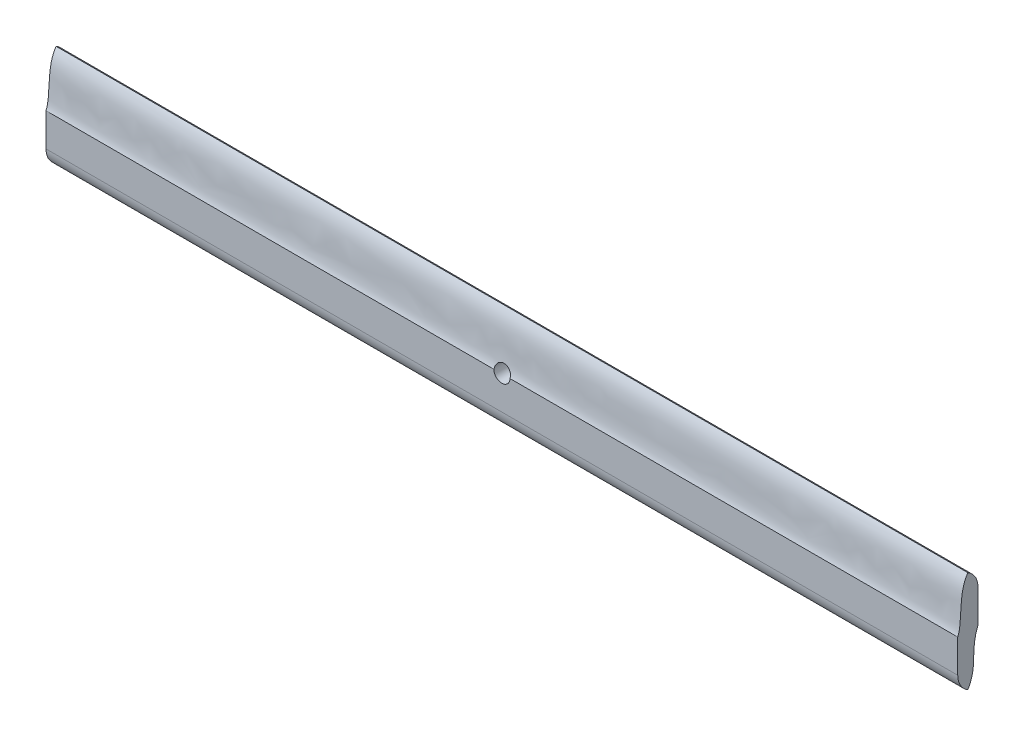
ISO-10303-21;
HEADER;
FILE_DESCRIPTION(('STEP AP214'),'2;1');
FILE_NAME('part.step','',(''),(''),'','','');
FILE_SCHEMA(('AUTOMOTIVE_DESIGN { 1 0 10303 214 1 1 1 1 }'));
ENDSEC;
DATA;
#1=APPLICATION_CONTEXT('core data for automotive mechanical design processes');
#2=APPLICATION_PROTOCOL_DEFINITION('international standard','automotive_design',2000,#1);
#3=PRODUCT_CONTEXT('',#1,'mechanical');
#4=PRODUCT('Part','Part','',(#3));
#5=PRODUCT_RELATED_PRODUCT_CATEGORY('part','',(#4));
#6=PRODUCT_DEFINITION_FORMATION('','',#4);
#7=PRODUCT_DEFINITION_CONTEXT('part definition',#1,'design');
#8=PRODUCT_DEFINITION('design','',#6,#7);
#9=PRODUCT_DEFINITION_SHAPE('','',#8);
#10=(LENGTH_UNIT() NAMED_UNIT(*) SI_UNIT(.MILLI.,.METRE.));
#11=(NAMED_UNIT(*) PLANE_ANGLE_UNIT() SI_UNIT($,.RADIAN.));
#12=(NAMED_UNIT(*) SI_UNIT($,.STERADIAN.) SOLID_ANGLE_UNIT());
#13=UNCERTAINTY_MEASURE_WITH_UNIT(LENGTH_MEASURE(1.E-05),#10,'distance_accuracy_value','');
#14=(GEOMETRIC_REPRESENTATION_CONTEXT(3) GLOBAL_UNCERTAINTY_ASSIGNED_CONTEXT((#13)) GLOBAL_UNIT_ASSIGNED_CONTEXT((#10,
#11,#12)) REPRESENTATION_CONTEXT('',''));
#15=CARTESIAN_POINT('',(0.,0.,0.));
#16=DIRECTION('',(0.,0.,1.));
#17=DIRECTION('',(1.,0.,0.));
#18=AXIS2_PLACEMENT_3D('',#15,#16,#17);
#19=CARTESIAN_POINT('',(0.,0.,1.));
#20=DIRECTION('',(0.,0.,1.));
#21=DIRECTION('',(1.,0.,0.));
#22=AXIS2_PLACEMENT_3D('',#19,#20,#21);
#23=PLANE('',#22);
#24=DIRECTION('',(0.,-1.,0.));
#25=VECTOR('',#24,1.);
#26=CARTESIAN_POINT('',(-22.5,0.,1.));
#27=LINE('',#26,#25);
#28=CARTESIAN_POINT('',(-22.5,0.,1.));
#29=VERTEX_POINT('',#28);
#30=CARTESIAN_POINT('',(-22.5,-1.63397459621557,1.));
#31=VERTEX_POINT('',#30);
#32=EDGE_CURVE('E116',#29,#31,#27,.T.);
#33=ORIENTED_EDGE('',*,*,#32,.T.);
#34=DIRECTION('',(-1.,0.,0.));
#35=VECTOR('',#34,1.);
#36=CARTESIAN_POINT('',(22.5,-1.63397459621557,1.));
#37=LINE('',#36,#35);
#38=CARTESIAN_POINT('',(22.5,-1.63397459621557,1.));
#39=VERTEX_POINT('',#38);
#40=EDGE_CURVE('E125',#31,#39,#37,.F.);
#41=ORIENTED_EDGE('',*,*,#40,.T.);
#42=DIRECTION('',(0.,-1.,0.));
#43=VECTOR('',#42,1.);
#44=CARTESIAN_POINT('',(22.5,0.,1.));
#45=LINE('',#44,#43);
#46=CARTESIAN_POINT('',(22.5,0.,1.));
#47=VERTEX_POINT('',#46);
#48=EDGE_CURVE('E135',#47,#39,#45,.T.);
#49=ORIENTED_EDGE('',*,*,#48,.F.);
#50=DIRECTION('',(1.,0.,0.));
#51=VECTOR('',#50,1.);
#52=CARTESIAN_POINT('',(-22.501,0.,1.));
#53=LINE('',#52,#51);
#54=CARTESIAN_POINT('',(0.4,0.,1.));
#55=VERTEX_POINT('',#54);
#56=EDGE_CURVE('E210',#55,#47,#53,.T.);
#57=ORIENTED_EDGE('',*,*,#56,.F.);
#58=CARTESIAN_POINT('',(0.,0.,1.));
#59=DIRECTION('',(0.,0.,1.));
#60=DIRECTION('',(1.,0.,0.));
#61=AXIS2_PLACEMENT_3D('',#58,#59,#60);
#62=CIRCLE('',#61,0.4);
#63=CARTESIAN_POINT('',(-0.4,0.,1.));
#64=VERTEX_POINT('',#63);
#65=EDGE_CURVE('E128',#64,#55,#62,.T.);
#66=ORIENTED_EDGE('',*,*,#65,.F.);
#67=EDGE_CURVE('E110',#29,#64,#53,.T.);
#68=ORIENTED_EDGE('',*,*,#67,.F.);
#69=EDGE_LOOP('',(#33,#41,#49,#57,#66,#68));
#70=FACE_BOUND('',#69,.T.);
#71=ADVANCED_FACE('F39',(#70),#23,.T.);
#72=CARTESIAN_POINT('',(0.,0.,0.));
#73=DIRECTION('',(0.,0.,1.));
#74=DIRECTION('',(1.,0.,0.));
#75=AXIS2_PLACEMENT_3D('',#72,#73,#74);
#76=PLANE('',#75);
#77=DIRECTION('',(0.,-1.,0.));
#78=VECTOR('',#77,1.);
#79=CARTESIAN_POINT('',(-22.5,0.,0.));
#80=LINE('',#79,#78);
#81=CARTESIAN_POINT('',(-22.5,1.63397459621555,0.));
#82=VERTEX_POINT('',#81);
#83=CARTESIAN_POINT('',(-22.5,0.,0.));
#84=VERTEX_POINT('',#83);
#85=EDGE_CURVE('E138',#82,#84,#80,.T.);
#86=ORIENTED_EDGE('',*,*,#85,.F.);
#87=DIRECTION('',(1.,0.,0.));
#88=VECTOR('',#87,1.);
#89=CARTESIAN_POINT('',(0.,1.63397459621555,0.));
#90=LINE('',#89,#88);
#91=CARTESIAN_POINT('',(22.5,1.63397459621555,0.));
#92=VERTEX_POINT('',#91);
#93=EDGE_CURVE('E11',#82,#92,#90,.T.);
#94=ORIENTED_EDGE('',*,*,#93,.T.);
#95=DIRECTION('',(0.,-1.,0.));
#96=VECTOR('',#95,1.);
#97=CARTESIAN_POINT('',(22.5,0.,0.));
#98=LINE('',#97,#96);
#99=CARTESIAN_POINT('',(22.5,0.,0.));
#100=VERTEX_POINT('',#99);
#101=EDGE_CURVE('E132',#92,#100,#98,.T.);
#102=ORIENTED_EDGE('',*,*,#101,.T.);
#103=DIRECTION('',(1.,0.,0.));
#104=VECTOR('',#103,1.);
#105=CARTESIAN_POINT('',(-22.501,0.,0.));
#106=LINE('',#105,#104);
#107=CARTESIAN_POINT('',(0.4,0.,0.));
#108=VERTEX_POINT('',#107);
#109=EDGE_CURVE('E146',#108,#100,#106,.T.);
#110=ORIENTED_EDGE('',*,*,#109,.F.);
#111=CARTESIAN_POINT('',(0.,0.,0.));
#112=DIRECTION('',(0.,0.,1.));
#113=DIRECTION('',(1.,0.,0.));
#114=AXIS2_PLACEMENT_3D('',#111,#112,#113);
#115=CIRCLE('',#114,0.4);
#116=CARTESIAN_POINT('',(-0.4,0.,0.));
#117=VERTEX_POINT('',#116);
#118=EDGE_CURVE('E129',#108,#117,#115,.T.);
#119=ORIENTED_EDGE('',*,*,#118,.T.);
#120=EDGE_CURVE('E140',#84,#117,#106,.T.);
#121=ORIENTED_EDGE('',*,*,#120,.F.);
#122=EDGE_LOOP('',(#86,#94,#102,#110,#119,#121));
#123=FACE_BOUND('',#122,.T.);
#124=ADVANCED_FACE('F188',(#123),#76,.F.);
#125=CARTESIAN_POINT('',(0.,0.,1.));
#126=DIRECTION('',(0.,0.,-1.));
#127=DIRECTION('',(-1.,0.,0.));
#128=AXIS2_PLACEMENT_3D('',#125,#126,#127);
#129=CYLINDRICAL_SURFACE('',#128,0.4);
#130=ORIENTED_EDGE('',*,*,#118,.F.);
#131=CARTESIAN_POINT('',(-0.4,0.,0.));
#132=CARTESIAN_POINT('',(-0.400019418484966,-0.0225828552914633,0.00975252850175012));
#133=CARTESIAN_POINT('',(-0.398087112566692,-0.045358150931048,0.0191235103373906));
#134=CARTESIAN_POINT('',(-0.39026721654042,-0.0906471336001426,0.0369350819772397));
#135=CARTESIAN_POINT('',(-0.384370860167613,-0.113160128067025,0.0453735613445234));
#136=CARTESIAN_POINT('',(-0.36855036295023,-0.157227811493201,0.061127976419653));
#137=CARTESIAN_POINT('',(-0.358615974354293,-0.178779906290879,0.0684409903258206));
#138=CARTESIAN_POINT('',(-0.334885060518131,-0.220038745700351,0.0818105149617717));
#139=CARTESIAN_POINT('',(-0.321093917806003,-0.239748011396451,0.087868756501004));
#140=CARTESIAN_POINT('',(-0.290876946755338,-0.275512619955264,0.098403799861016));
#141=CARTESIAN_POINT('',(-0.274646444231777,-0.291712315013126,0.102951132732179));
#142=CARTESIAN_POINT('',(-0.239467623126646,-0.321220573487471,0.11095047395857));
#143=CARTESIAN_POINT('',(-0.220516129583952,-0.334525713156539,0.114401187404967));
#144=CARTESIAN_POINT('',(-0.181329494862225,-0.357226428496143,0.12013071507054));
#145=CARTESIAN_POINT('',(-0.161182509036857,-0.366763521179389,0.122452910245844));
#146=CARTESIAN_POINT('',(-0.11948120709149,-0.38238791805563,0.126192134104626));
#147=CARTESIAN_POINT('',(-0.0979250965011786,-0.388470723997581,0.127607982826819));
#148=CARTESIAN_POINT('',(-0.0544229348991615,-0.396889197730581,0.129553722727017));
#149=CARTESIAN_POINT('',(-0.0324890433246798,-0.399284574738445,0.130097737287937));
#150=CARTESIAN_POINT('',(0.0115155003028174,-0.400440447734857,0.130361221801507));
#151=CARTESIAN_POINT('',(0.0335863163305489,-0.399195049703395,0.13007935473968));
#152=CARTESIAN_POINT('',(0.0771191243220451,-0.393108119106825,0.128681802730557));
#153=CARTESIAN_POINT('',(0.0985829916523304,-0.388279306282887,0.127569066960504));
#154=CARTESIAN_POINT('',(0.140340997840958,-0.37520961213297,0.124483710189106));
#155=CARTESIAN_POINT('',(0.160636986805997,-0.366974306793954,0.122512494131366));
#156=CARTESIAN_POINT('',(0.19959859245046,-0.347329783065582,0.117654760782187));
#157=CARTESIAN_POINT('',(0.218258377012538,-0.335909772998294,0.114765126607489));
#158=CARTESIAN_POINT('',(0.253339525682001,-0.310306459229285,0.108026864538563));
#159=CARTESIAN_POINT('',(0.269763669094178,-0.296126640781288,0.104179444502005));
#160=CARTESIAN_POINT('',(0.300164043786856,-0.265284496761625,0.0954368348069302));
#161=CARTESIAN_POINT('',(0.314109289888703,-0.248594993831648,0.0905298803616059));
#162=CARTESIAN_POINT('',(0.338983928167056,-0.213432330869125,0.0796974554316661));
#163=CARTESIAN_POINT('',(0.349916425116577,-0.194961033766741,0.0737730437830819));
#164=CARTESIAN_POINT('',(0.368890577608004,-0.156204075501865,0.0607447897876375));
#165=CARTESIAN_POINT('',(0.376832265907184,-0.135879949066595,0.0536101137311416));
#166=CARTESIAN_POINT('',(0.38925980661174,-0.0945607956075636,0.0384016121030154));
#167=CARTESIAN_POINT('',(0.393747457740293,-0.0735661237177748,0.0303282778715609));
#168=CARTESIAN_POINT('',(0.398859773064231,-0.0349964626587781,0.0148304352011251));
#169=CARTESIAN_POINT('',(0.400008068271592,-0.0174415486396513,0.00752593632392062));
#170=CARTESIAN_POINT('',(0.400000000000001,0.,0.));
#171=B_SPLINE_CURVE_WITH_KNOTS('',3,(#131,#132,#133,#134,#135,#136,#137,#138,#139,#140,#141,
#142,#143,#144,#145,#146,#147,#148,#149,#150,#151,#152,#153,#154,#155,#156,#157,#158,#159,#160,
#161,#162,#163,#164,#165,#166,#167,#168,#169,#170),.UNSPECIFIED.,.F.,.F.,(4,2,2,2,2,2,2,2,2,2,2,
2,2,2,2,2,2,2,2,4),(0.,0.0737556128806851,0.147674870849325,0.221782904758099,0.295788024447824,
0.365568849739502,0.435431769985183,0.502340763190064,0.569336688178808,0.635235915994796,
0.701241886563358,0.767014675382985,0.832680226050557,0.898571052605919,0.964379201905617,
1.03095954381258,1.09747101289863,1.16604144885195,1.23457615188352,1.29155890188987),.UNSPECIFIED.);
#172=EDGE_CURVE('E154',#117,#108,#171,.T.);
#173=ORIENTED_EDGE('',*,*,#172,.F.);
#174=EDGE_LOOP('',(#130,#173));
#175=FACE_BOUND('',#174,.T.);
#176=ORIENTED_EDGE('',*,*,#65,.T.);
#177=CARTESIAN_POINT('',(-0.4,0.,1.));
#178=CARTESIAN_POINT('',(-0.40003403073349,0.0211159611576562,0.990870799386106));
#179=CARTESIAN_POINT('',(-0.39832844222986,0.0425806333506437,0.982525346540343));
#180=CARTESIAN_POINT('',(-0.39136023685398,0.0854497966461446,0.96729674562164));
#181=CARTESIAN_POINT('',(-0.386097641886637,0.10685428811845,0.96041358854387));
#182=CARTESIAN_POINT('',(-0.371925427438219,0.148881970087852,0.947993579393862));
#183=CARTESIAN_POINT('',(-0.363009534764143,0.169503749682714,0.942459069324406));
#184=CARTESIAN_POINT('',(-0.341698772651093,0.209159956412339,0.932592674019484));
#185=CARTESIAN_POINT('',(-0.329306240369884,0.228195438817382,0.928259984742563));
#186=CARTESIAN_POINT('',(-0.301700031770594,0.26356810944884,0.920720147454865));
#187=CARTESIAN_POINT('',(-0.286563907456625,0.27996049028838,0.917487759881977));
#188=CARTESIAN_POINT('',(-0.253667567763012,0.310081842041965,0.911854444158947));
#189=CARTESIAN_POINT('',(-0.235903827235219,0.323807176774292,0.909454647691216));
#190=CARTESIAN_POINT('',(-0.198449701491526,0.348009058394622,0.905391334411472));
#191=CARTESIAN_POINT('',(-0.178778869699872,0.358514763457687,0.903721147360579));
#192=CARTESIAN_POINT('',(-0.137901089715481,0.376137401995199,0.900994360600079));
#193=CARTESIAN_POINT('',(-0.116692046092717,0.383249608852961,0.899938616266973));
#194=CARTESIAN_POINT('',(-0.0734276445742564,0.393831150719624,0.898388582301311));
#195=CARTESIAN_POINT('',(-0.0513748226456195,0.397310630040593,0.897892728867911));
#196=CARTESIAN_POINT('',(-0.00695492658758669,0.400560062293611,0.897429243410354));
#197=CARTESIAN_POINT('',(0.0154126096036314,0.400323829723718,0.897462492177493));
#198=CARTESIAN_POINT('',(0.0597860721978491,0.396134052569771,0.898061178495192));
#199=CARTESIAN_POINT('',(0.081792053249975,0.392181075130857,0.89862653485046));
#200=CARTESIAN_POINT('',(0.124784221066249,0.380687765151841,0.900319335643521));
#201=CARTESIAN_POINT('',(0.145772045434113,0.373153418995837,0.901445842249014));
#202=CARTESIAN_POINT('',(0.186204674802012,0.35471432882447,0.904324038090652));
#203=CARTESIAN_POINT('',(0.205647016531609,0.343804334745474,0.906076701835152));
#204=CARTESIAN_POINT('',(0.242376497283023,0.318973857491457,0.910295927172866));
#205=CARTESIAN_POINT('',(0.259666604566413,0.305057594585082,0.91276148960844));
#206=CARTESIAN_POINT('',(0.291672560035342,0.274619148968005,0.918532605715713));
#207=CARTESIAN_POINT('',(0.306383728173518,0.258092330034749,0.921839660344581));
#208=CARTESIAN_POINT('',(0.332784465284995,0.223014749218062,0.929429637143132));
#209=CARTESIAN_POINT('',(0.344478141539978,0.204466787895134,0.933711217719259));
#210=CARTESIAN_POINT('',(0.364638810129969,0.165875159451262,0.943422951724967));
#211=CARTESIAN_POINT('',(0.37309267357059,0.145825792050104,0.948857642706383));
#212=CARTESIAN_POINT('',(0.386574892962546,0.104983277358981,0.961010334898249));
#213=CARTESIAN_POINT('',(0.391605041242536,0.0841905252440096,0.967727662281138));
#214=CARTESIAN_POINT('',(0.396651062093906,0.0527668697922599,0.978915703908923));
#215=CARTESIAN_POINT('',(0.397916099040571,0.0421385532076676,0.982878865390228));
#216=CARTESIAN_POINT('',(0.399589951536753,0.0209811748854759,0.991165552941457));
#217=CARTESIAN_POINT('',(0.400000579134718,0.0104519503335323,0.995488296098378));
#218=CARTESIAN_POINT('',(0.400000000001937,0.,1.));
#219=B_SPLINE_CURVE_WITH_KNOTS('',3,(#177,#178,#179,#180,#181,#182,#183,#184,#185,#186,#187,
#188,#189,#190,#191,#192,#193,#194,#195,#196,#197,#198,#199,#200,#201,#202,#203,#204,#205,#206,
#207,#208,#209,#210,#211,#212,#213,#214,#215,#216,#217,#218),.UNSPECIFIED.,.F.,.F.,(4,2,2,2,2,2,
2,2,2,2,2,2,2,2,2,2,2,2,2,2,4),(0.,0.0689492126987055,0.13789800079533,0.206965682520536,
0.275987044561247,0.343297365312391,0.410698821062572,0.477470480650381,0.544334873259446,
0.611012045001497,0.677800225178503,0.744578215674219,0.811244974832548,0.878015944851066,
0.944693782425935,1.01149139633083,1.0781976027605,1.14517133837151,1.21210998594013,
1.24631729877354,1.28045198979909),.UNSPECIFIED.);
#220=EDGE_CURVE('E118',#64,#55,#219,.T.);
#221=ORIENTED_EDGE('',*,*,#220,.F.);
#222=EDGE_LOOP('',(#176,#221));
#223=FACE_BOUND('',#222,.T.);
#224=ADVANCED_FACE('F185',(#175,#223),#129,.F.);
#225=CARTESIAN_POINT('',(-22.5,0.,0.));
#226=DIRECTION('',(-1.,0.,0.));
#227=DIRECTION('',(0.,0.,1.));
#228=AXIS2_PLACEMENT_3D('',#225,#226,#227);
#229=PLANE('',#228);
#230=CARTESIAN_POINT('',(-22.5,-2.5,0.5));
#231=CARTESIAN_POINT('',(-22.5,-1.6692066537054,0.));
#232=CARTESIAN_POINT('',(-22.5,-0.925969653236436,0.399128588954689));
#233=CARTESIAN_POINT('',(-22.5,0.,0.));
#234=B_SPLINE_CURVE_WITH_KNOTS('',3,(#230,#231,#232,#233),.UNSPECIFIED.,.F.,.F.,(4,4),(0.,1.),.UNSPECIFIED.);
#235=CARTESIAN_POINT('',(-22.5,-2.49999999999999,0.5));
#236=VERTEX_POINT('',#235);
#237=EDGE_CURVE('E117',#236,#84,#234,.T.);
#238=ORIENTED_EDGE('',*,*,#237,.F.);
#239=CARTESIAN_POINT('',(-22.5,-1.63397459621557,0.));
#240=DIRECTION('',(-1.,0.,0.));
#241=DIRECTION('',(0.,0.,1.));
#242=AXIS2_PLACEMENT_3D('',#239,#240,#241);
#243=CIRCLE('',#242,1.);
#244=EDGE_CURVE('E47',#236,#31,#243,.T.);
#245=ORIENTED_EDGE('',*,*,#244,.T.);
#246=ORIENTED_EDGE('',*,*,#32,.F.);
#247=CARTESIAN_POINT('',(-22.5,2.5,0.5));
#248=CARTESIAN_POINT('',(-22.5,1.79605827517075,1.));
#249=CARTESIAN_POINT('',(-22.5,0.619216623627633,0.732746225240194));
#250=CARTESIAN_POINT('',(-22.5,0.,1.));
#251=B_SPLINE_CURVE_WITH_KNOTS('',3,(#247,#248,#249,#250),.UNSPECIFIED.,.F.,.F.,(4,4),(0.,1.),.UNSPECIFIED.);
#252=CARTESIAN_POINT('',(-22.5,2.5,0.5));
#253=VERTEX_POINT('',#252);
#254=EDGE_CURVE('E106',#253,#29,#251,.T.);
#255=ORIENTED_EDGE('',*,*,#254,.F.);
#256=CARTESIAN_POINT('',(-22.5,1.63397459621555,1.));
#257=DIRECTION('',(-1.,0.,0.));
#258=DIRECTION('',(0.,0.,1.));
#259=AXIS2_PLACEMENT_3D('',#256,#257,#258);
#260=CIRCLE('',#259,1.);
#261=EDGE_CURVE('E54',#253,#82,#260,.T.);
#262=ORIENTED_EDGE('',*,*,#261,.T.);
#263=ORIENTED_EDGE('',*,*,#85,.T.);
#264=EDGE_LOOP('',(#238,#245,#246,#255,#262,#263));
#265=FACE_BOUND('',#264,.T.);
#266=ADVANCED_FACE('F114',(#265),#229,.T.);
#267=CARTESIAN_POINT('',(22.5,0.,0.));
#268=DIRECTION('',(-1.,0.,0.));
#269=DIRECTION('',(0.,0.,1.));
#270=AXIS2_PLACEMENT_3D('',#267,#268,#269);
#271=PLANE('',#270);
#272=ORIENTED_EDGE('',*,*,#48,.T.);
#273=CARTESIAN_POINT('',(22.5,-1.63397459621557,0.));
#274=DIRECTION('',(-1.,0.,0.));
#275=DIRECTION('',(0.,0.,1.));
#276=AXIS2_PLACEMENT_3D('',#273,#274,#275);
#277=CIRCLE('',#276,1.);
#278=CARTESIAN_POINT('',(22.5,-2.5,0.5));
#279=VERTEX_POINT('',#278);
#280=EDGE_CURVE('E120',#39,#279,#277,.F.);
#281=ORIENTED_EDGE('',*,*,#280,.T.);
#282=CARTESIAN_POINT('',(22.5,-2.5,0.5));
#283=CARTESIAN_POINT('',(22.5,-1.6692066537054,0.));
#284=CARTESIAN_POINT('',(22.5,-0.925969653236436,0.399128588954689));
#285=CARTESIAN_POINT('',(22.5,0.,0.));
#286=B_SPLINE_CURVE_WITH_KNOTS('',3,(#282,#283,#284,#285),.UNSPECIFIED.,.F.,.F.,(4,4),(0.,1.),.UNSPECIFIED.);
#287=EDGE_CURVE('E147',#279,#100,#286,.T.);
#288=ORIENTED_EDGE('',*,*,#287,.T.);
#289=ORIENTED_EDGE('',*,*,#101,.F.);
#290=CARTESIAN_POINT('',(22.5,1.63397459621555,1.));
#291=DIRECTION('',(-1.,0.,0.));
#292=DIRECTION('',(0.,0.,1.));
#293=AXIS2_PLACEMENT_3D('',#290,#291,#292);
#294=CIRCLE('',#293,1.);
#295=CARTESIAN_POINT('',(22.5,2.5,0.5));
#296=VERTEX_POINT('',#295);
#297=EDGE_CURVE('E62',#92,#296,#294,.F.);
#298=ORIENTED_EDGE('',*,*,#297,.T.);
#299=CARTESIAN_POINT('',(22.5,2.5,0.5));
#300=CARTESIAN_POINT('',(22.5,1.79605827517075,1.));
#301=CARTESIAN_POINT('',(22.5,0.619216623627633,0.732746225240194));
#302=CARTESIAN_POINT('',(22.5,0.,1.));
#303=B_SPLINE_CURVE_WITH_KNOTS('',3,(#299,#300,#301,#302),.UNSPECIFIED.,.F.,.F.,(4,4),(0.,1.),.UNSPECIFIED.);
#304=EDGE_CURVE('E109',#296,#47,#303,.T.);
#305=ORIENTED_EDGE('',*,*,#304,.T.);
#306=EDGE_LOOP('',(#272,#281,#288,#289,#298,#305));
#307=FACE_BOUND('',#306,.T.);
#308=ADVANCED_FACE('F176',(#307),#271,.F.);
#309=CARTESIAN_POINT('',(-22.501,-2.5,0.5));
#310=CARTESIAN_POINT('',(-22.501,-1.6692066537054,0.));
#311=CARTESIAN_POINT('',(-22.501,-0.925969653236436,0.399128588954689));
#312=CARTESIAN_POINT('',(-22.501,0.,0.));
#313=B_SPLINE_CURVE_WITH_KNOTS('',3,(#309,#310,#311,#312),.UNSPECIFIED.,.F.,.F.,(4,4),(0.,1.),.UNSPECIFIED.);
#314=DIRECTION('',(1.,0.,0.));
#315=VECTOR('',#314,1.);
#316=SURFACE_OF_LINEAR_EXTRUSION('',#313,#315);
#317=ORIENTED_EDGE('',*,*,#172,.T.);
#318=ORIENTED_EDGE('',*,*,#109,.T.);
#319=ORIENTED_EDGE('',*,*,#287,.F.);
#320=DIRECTION('',(1.,0.,0.));
#321=VECTOR('',#320,1.);
#322=CARTESIAN_POINT('',(-22.501,-2.5,0.5));
#323=LINE('',#322,#321);
#324=EDGE_CURVE('E143',#236,#279,#323,.T.);
#325=ORIENTED_EDGE('',*,*,#324,.F.);
#326=ORIENTED_EDGE('',*,*,#237,.T.);
#327=ORIENTED_EDGE('',*,*,#120,.T.);
#328=EDGE_LOOP('',(#317,#318,#319,#325,#326,#327));
#329=FACE_BOUND('',#328,.T.);
#330=ADVANCED_FACE('F172',(#329),#316,.T.);
#331=CARTESIAN_POINT('',(-22.501,2.5,0.5));
#332=CARTESIAN_POINT('',(-22.501,1.79605827517075,1.));
#333=CARTESIAN_POINT('',(-22.501,0.619216623627633,0.732746225240194));
#334=CARTESIAN_POINT('',(-22.501,0.,1.));
#335=B_SPLINE_CURVE_WITH_KNOTS('',3,(#331,#332,#333,#334),.UNSPECIFIED.,.F.,.F.,(4,4),(0.,1.),.UNSPECIFIED.);
#336=DIRECTION('',(1.,0.,0.));
#337=VECTOR('',#336,1.);
#338=SURFACE_OF_LINEAR_EXTRUSION('',#335,#337);
#339=ORIENTED_EDGE('',*,*,#220,.T.);
#340=ORIENTED_EDGE('',*,*,#56,.T.);
#341=ORIENTED_EDGE('',*,*,#304,.F.);
#342=DIRECTION('',(1.,0.,0.));
#343=VECTOR('',#342,1.);
#344=CARTESIAN_POINT('',(-22.501,2.5,0.5));
#345=LINE('',#344,#343);
#346=EDGE_CURVE('E104',#253,#296,#345,.T.);
#347=ORIENTED_EDGE('',*,*,#346,.F.);
#348=ORIENTED_EDGE('',*,*,#254,.T.);
#349=ORIENTED_EDGE('',*,*,#67,.T.);
#350=EDGE_LOOP('',(#339,#340,#341,#347,#348,#349));
#351=FACE_BOUND('',#350,.T.);
#352=ADVANCED_FACE('F105',(#351),#338,.T.);
#353=CARTESIAN_POINT('',(0.,-1.63397459621557,0.));
#354=DIRECTION('',(1.,0.,0.));
#355=DIRECTION('',(0.,0.,-1.));
#356=AXIS2_PLACEMENT_3D('',#353,#354,#355);
#357=CYLINDRICAL_SURFACE('',#356,1.);
#358=ORIENTED_EDGE('',*,*,#244,.F.);
#359=ORIENTED_EDGE('',*,*,#324,.T.);
#360=ORIENTED_EDGE('',*,*,#280,.F.);
#361=ORIENTED_EDGE('',*,*,#40,.F.);
#362=EDGE_LOOP('',(#358,#359,#360,#361));
#363=FACE_BOUND('',#362,.T.);
#364=ADVANCED_FACE('F195',(#363),#357,.T.);
#365=CARTESIAN_POINT('',(0.,1.63397459621555,1.));
#366=DIRECTION('',(1.,0.,0.));
#367=DIRECTION('',(0.,0.,-1.));
#368=AXIS2_PLACEMENT_3D('',#365,#366,#367);
#369=CYLINDRICAL_SURFACE('',#368,1.);
#370=ORIENTED_EDGE('',*,*,#261,.F.);
#371=ORIENTED_EDGE('',*,*,#346,.T.);
#372=ORIENTED_EDGE('',*,*,#297,.F.);
#373=ORIENTED_EDGE('',*,*,#93,.F.);
#374=EDGE_LOOP('',(#370,#371,#372,#373));
#375=FACE_BOUND('',#374,.T.);
#376=ADVANCED_FACE('F41',(#375),#369,.T.);
#377=CLOSED_SHELL('',(#71,#124,#224,#266,#308,#330,#352,#364,#376));
#378=MANIFOLD_SOLID_BREP('B2',#377);
#379=ADVANCED_BREP_SHAPE_REPRESENTATION('',(#18,#378),#14);
#380=SHAPE_DEFINITION_REPRESENTATION(#9,#379);
ENDSEC;
END-ISO-10303-21;
